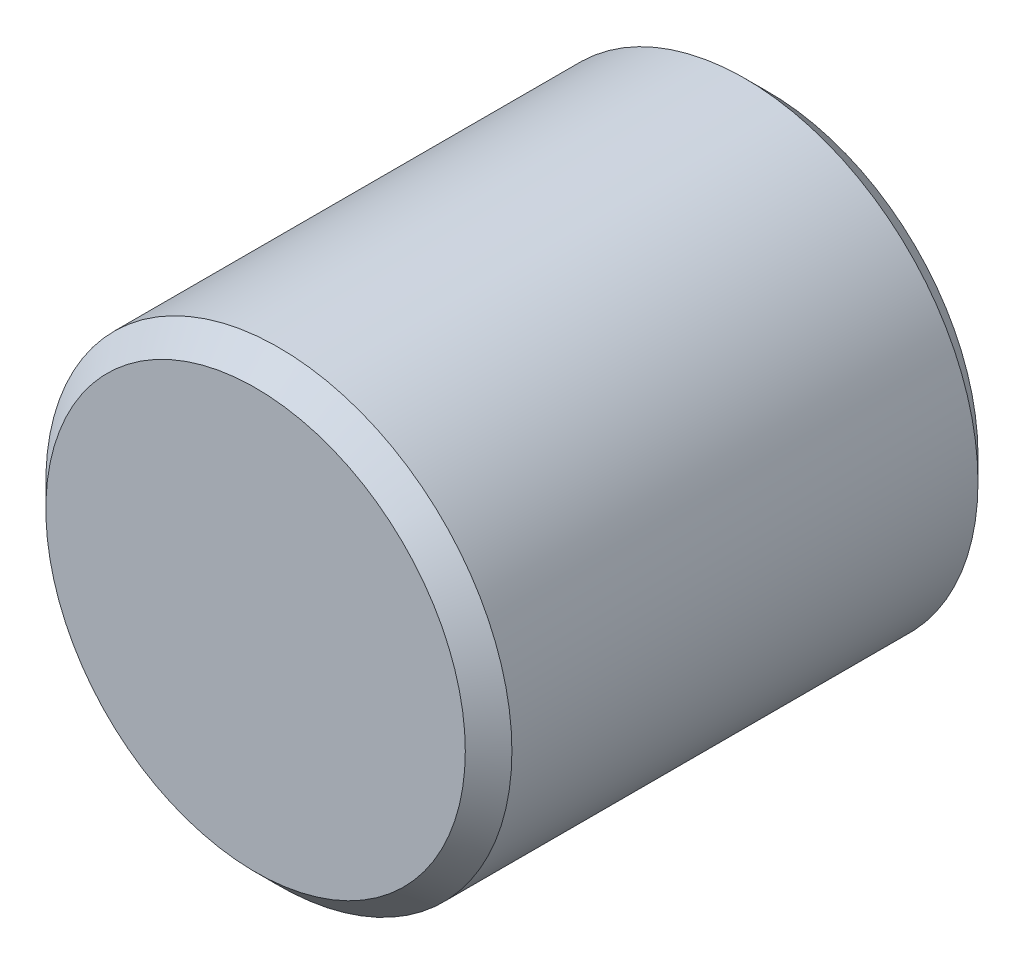
ISO-10303-21;
HEADER;
FILE_DESCRIPTION(('STEP AP214'),'2;1');
FILE_NAME('part.step','',(''),(''),'','','');
FILE_SCHEMA(('AUTOMOTIVE_DESIGN { 1 0 10303 214 1 1 1 1 }'));
ENDSEC;
DATA;
#1=APPLICATION_CONTEXT('core data for automotive mechanical design processes');
#2=APPLICATION_PROTOCOL_DEFINITION('international standard','automotive_design',2000,#1);
#3=PRODUCT_CONTEXT('',#1,'mechanical');
#4=PRODUCT('Part','Part','',(#3));
#5=PRODUCT_RELATED_PRODUCT_CATEGORY('part','',(#4));
#6=PRODUCT_DEFINITION_FORMATION('','',#4);
#7=PRODUCT_DEFINITION_CONTEXT('part definition',#1,'design');
#8=PRODUCT_DEFINITION('design','',#6,#7);
#9=PRODUCT_DEFINITION_SHAPE('','',#8);
#10=(LENGTH_UNIT() NAMED_UNIT(*) SI_UNIT(.MILLI.,.METRE.));
#11=(NAMED_UNIT(*) PLANE_ANGLE_UNIT() SI_UNIT($,.RADIAN.));
#12=(NAMED_UNIT(*) SI_UNIT($,.STERADIAN.) SOLID_ANGLE_UNIT());
#13=UNCERTAINTY_MEASURE_WITH_UNIT(LENGTH_MEASURE(1.E-05),#10,'distance_accuracy_value','');
#14=(GEOMETRIC_REPRESENTATION_CONTEXT(3) GLOBAL_UNCERTAINTY_ASSIGNED_CONTEXT((#13)) GLOBAL_UNIT_ASSIGNED_CONTEXT((#10,
#11,#12)) REPRESENTATION_CONTEXT('',''));
#15=CARTESIAN_POINT('',(0.,0.,0.));
#16=DIRECTION('',(0.,0.,1.));
#17=DIRECTION('',(1.,0.,0.));
#18=AXIS2_PLACEMENT_3D('',#15,#16,#17);
#19=CARTESIAN_POINT('',(0.,0.,11.));
#20=DIRECTION('',(0.,0.,-1.));
#21=DIRECTION('',(-1.,0.,0.));
#22=AXIS2_PLACEMENT_3D('',#19,#20,#21);
#23=CYLINDRICAL_SURFACE('',#22,5.);
#24=CARTESIAN_POINT('',(0.,0.,0.5));
#25=DIRECTION('',(0.,0.,1.));
#26=DIRECTION('',(1.,0.,0.));
#27=AXIS2_PLACEMENT_3D('',#24,#25,#26);
#28=CIRCLE('',#27,5.);
#29=CARTESIAN_POINT('',(5.,0.,0.5));
#30=VERTEX_POINT('',#29);
#31=EDGE_CURVE('E63',#30,#30,#28,.T.);
#32=ORIENTED_EDGE('',*,*,#31,.T.);
#33=EDGE_LOOP('',(#32));
#34=FACE_BOUND('',#33,.T.);
#35=CARTESIAN_POINT('',(0.,0.,10.5));
#36=DIRECTION('',(0.,0.,1.));
#37=DIRECTION('',(1.,0.,0.));
#38=AXIS2_PLACEMENT_3D('',#35,#36,#37);
#39=CIRCLE('',#38,5.);
#40=CARTESIAN_POINT('',(5.,0.,10.5));
#41=VERTEX_POINT('',#40);
#42=EDGE_CURVE('E59',#41,#41,#39,.F.);
#43=ORIENTED_EDGE('',*,*,#42,.T.);
#44=EDGE_LOOP('',(#43));
#45=FACE_BOUND('',#44,.T.);
#46=ADVANCED_FACE('F39',(#34,#45),#23,.T.);
#47=CARTESIAN_POINT('',(0.,0.,11.));
#48=DIRECTION('',(0.,0.,1.));
#49=DIRECTION('',(1.,0.,0.));
#50=AXIS2_PLACEMENT_3D('',#47,#48,#49);
#51=PLANE('',#50);
#52=CARTESIAN_POINT('',(0.,0.,11.));
#53=DIRECTION('',(0.,0.,1.));
#54=DIRECTION('',(1.,0.,0.));
#55=AXIS2_PLACEMENT_3D('',#52,#53,#54);
#56=CIRCLE('',#55,4.5);
#57=CARTESIAN_POINT('',(4.5,0.,11.));
#58=VERTEX_POINT('',#57);
#59=EDGE_CURVE('E11',#58,#58,#56,.T.);
#60=ORIENTED_EDGE('',*,*,#59,.T.);
#61=EDGE_LOOP('',(#60));
#62=FACE_BOUND('',#61,.T.);
#63=ADVANCED_FACE('F81',(#62),#51,.T.);
#64=CARTESIAN_POINT('',(0.,0.,0.));
#65=DIRECTION('',(0.,0.,1.));
#66=DIRECTION('',(1.,0.,0.));
#67=AXIS2_PLACEMENT_3D('',#64,#65,#66);
#68=PLANE('',#67);
#69=CARTESIAN_POINT('',(0.,0.,0.));
#70=DIRECTION('',(0.,0.,1.));
#71=DIRECTION('',(1.,0.,0.));
#72=AXIS2_PLACEMENT_3D('',#69,#70,#71);
#73=CIRCLE('',#72,4.5);
#74=CARTESIAN_POINT('',(4.5,0.,0.));
#75=VERTEX_POINT('',#74);
#76=EDGE_CURVE('E46',#75,#75,#73,.F.);
#77=ORIENTED_EDGE('',*,*,#76,.T.);
#78=EDGE_LOOP('',(#77));
#79=FACE_BOUND('',#78,.T.);
#80=CARTESIAN_POINT('',(0.,0.,0.));
#81=DIRECTION('',(0.,0.,-1.));
#82=DIRECTION('',(-1.,0.,0.));
#83=AXIS2_PLACEMENT_3D('',#80,#81,#82);
#84=CIRCLE('',#83,1.24999999999999);
#85=CARTESIAN_POINT('',(-1.24999999999999,0.,0.));
#86=VERTEX_POINT('',#85);
#87=EDGE_CURVE('E60',#86,#86,#84,.T.);
#88=ORIENTED_EDGE('',*,*,#87,.F.);
#89=EDGE_LOOP('',(#88));
#90=FACE_BOUND('',#89,.T.);
#91=ADVANCED_FACE('F53',(#79,#90),#68,.F.);
#92=CARTESIAN_POINT('',(0.,0.,7.5));
#93=DIRECTION('',(0.,0.,-1.));
#94=DIRECTION('',(-1.,0.,0.));
#95=AXIS2_PLACEMENT_3D('',#92,#93,#94);
#96=CONICAL_SURFACE('',#95,1.25,1.02974425867665);
#97=CARTESIAN_POINT('',(0.,0.,8.25107577378445));
#98=VERTEX_POINT('',#97);
#99=VERTEX_LOOP('',#98);
#100=FACE_BOUND('',#99,.T.);
#101=CARTESIAN_POINT('',(0.,0.,7.5));
#102=DIRECTION('',(0.,0.,-1.));
#103=DIRECTION('',(-1.,0.,0.));
#104=AXIS2_PLACEMENT_3D('',#101,#102,#103);
#105=CIRCLE('',#104,1.25);
#106=CARTESIAN_POINT('',(-1.25,0.,7.5));
#107=VERTEX_POINT('',#106);
#108=EDGE_CURVE('E57',#107,#107,#105,.T.);
#109=ORIENTED_EDGE('',*,*,#108,.T.);
#110=EDGE_LOOP('',(#109));
#111=FACE_BOUND('',#110,.T.);
#112=ADVANCED_FACE('F49',(#100,#111),#96,.F.);
#113=CARTESIAN_POINT('',(0.,0.,0.));
#114=DIRECTION('',(0.,0.,-1.));
#115=DIRECTION('',(-1.,0.,0.));
#116=AXIS2_PLACEMENT_3D('',#113,#114,#115);
#117=CYLINDRICAL_SURFACE('',#116,1.24999999999999);
#118=ORIENTED_EDGE('',*,*,#108,.F.);
#119=EDGE_LOOP('',(#118));
#120=FACE_BOUND('',#119,.T.);
#121=ORIENTED_EDGE('',*,*,#87,.T.);
#122=EDGE_LOOP('',(#121));
#123=FACE_BOUND('',#122,.T.);
#124=ADVANCED_FACE('F52',(#120,#123),#117,.F.);
#125=CARTESIAN_POINT('',(0.,0.,0.5));
#126=DIRECTION('',(0.,0.,1.));
#127=DIRECTION('',(1.,0.,0.));
#128=AXIS2_PLACEMENT_3D('',#125,#126,#127);
#129=CONICAL_SURFACE('',#128,5.,0.785398163397451);
#130=ORIENTED_EDGE('',*,*,#76,.F.);
#131=EDGE_LOOP('',(#130));
#132=FACE_BOUND('',#131,.T.);
#133=ORIENTED_EDGE('',*,*,#31,.F.);
#134=EDGE_LOOP('',(#133));
#135=FACE_BOUND('',#134,.T.);
#136=ADVANCED_FACE('F74',(#132,#135),#129,.T.);
#137=CARTESIAN_POINT('',(0.,0.,11.));
#138=DIRECTION('',(0.,0.,-1.));
#139=DIRECTION('',(-1.,0.,0.));
#140=AXIS2_PLACEMENT_3D('',#137,#138,#139);
#141=CONICAL_SURFACE('',#140,4.5,0.785398163397444);
#142=ORIENTED_EDGE('',*,*,#42,.F.);
#143=EDGE_LOOP('',(#142));
#144=FACE_BOUND('',#143,.T.);
#145=ORIENTED_EDGE('',*,*,#59,.F.);
#146=EDGE_LOOP('',(#145));
#147=FACE_BOUND('',#146,.T.);
#148=ADVANCED_FACE('F41',(#144,#147),#141,.T.);
#149=CLOSED_SHELL('',(#46,#63,#91,#112,#124,#136,#148));
#150=MANIFOLD_SOLID_BREP('B2',#149);
#151=ADVANCED_BREP_SHAPE_REPRESENTATION('',(#18,#150),#14);
#152=SHAPE_DEFINITION_REPRESENTATION(#9,#151);
ENDSEC;
END-ISO-10303-21;
